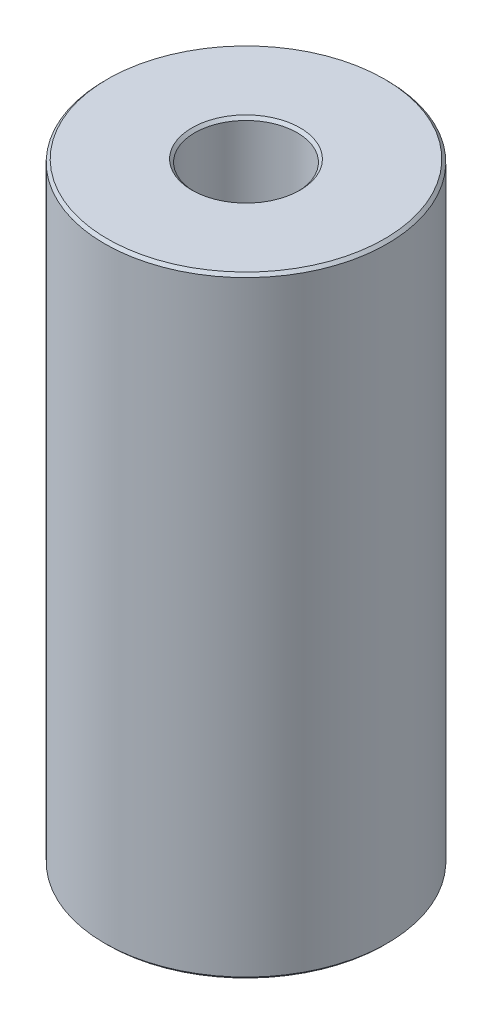
ISO-10303-21;
HEADER;
FILE_DESCRIPTION(('STEP AP214'),'2;1');
FILE_NAME('part.step','',(''),(''),'','','');
FILE_SCHEMA(('AUTOMOTIVE_DESIGN { 1 0 10303 214 1 1 1 1 }'));
ENDSEC;
DATA;
#1=APPLICATION_CONTEXT('core data for automotive mechanical design processes');
#2=APPLICATION_PROTOCOL_DEFINITION('international standard','automotive_design',2000,#1);
#3=PRODUCT_CONTEXT('',#1,'mechanical');
#4=PRODUCT('Part','Part','',(#3));
#5=PRODUCT_RELATED_PRODUCT_CATEGORY('part','',(#4));
#6=PRODUCT_DEFINITION_FORMATION('','',#4);
#7=PRODUCT_DEFINITION_CONTEXT('part definition',#1,'design');
#8=PRODUCT_DEFINITION('design','',#6,#7);
#9=PRODUCT_DEFINITION_SHAPE('','',#8);
#10=(LENGTH_UNIT() NAMED_UNIT(*) SI_UNIT(.MILLI.,.METRE.));
#11=(NAMED_UNIT(*) PLANE_ANGLE_UNIT() SI_UNIT($,.RADIAN.));
#12=(NAMED_UNIT(*) SI_UNIT($,.STERADIAN.) SOLID_ANGLE_UNIT());
#13=UNCERTAINTY_MEASURE_WITH_UNIT(LENGTH_MEASURE(1.E-05),#10,'distance_accuracy_value','');
#14=(GEOMETRIC_REPRESENTATION_CONTEXT(3) GLOBAL_UNCERTAINTY_ASSIGNED_CONTEXT((#13)) GLOBAL_UNIT_ASSIGNED_CONTEXT((#10,
#11,#12)) REPRESENTATION_CONTEXT('',''));
#15=CARTESIAN_POINT('',(0.,0.,0.));
#16=DIRECTION('',(0.,0.,1.));
#17=DIRECTION('',(1.,0.,0.));
#18=AXIS2_PLACEMENT_3D('',#15,#16,#17);
#19=CARTESIAN_POINT('',(0.,75.7217273491963,0.));
#20=DIRECTION('',(0.,-1.,0.));
#21=DIRECTION('',(0.,0.,-1.));
#22=AXIS2_PLACEMENT_3D('',#19,#20,#21);
#23=CYLINDRICAL_SURFACE('',#22,17.5);
#24=CARTESIAN_POINT('',(0.,0.350058036582654,0.));
#25=DIRECTION('',(0.,1.,0.));
#26=DIRECTION('',(0.,0.,1.));
#27=AXIS2_PLACEMENT_3D('',#24,#25,#26);
#28=CIRCLE('',#27,17.5);
#29=CARTESIAN_POINT('',(0.,0.350058036582654,-17.5));
#30=VERTEX_POINT('',#29);
#31=EDGE_CURVE('E10',#30,#30,#28,.T.);
#32=CARTESIAN_POINT('',(0.,75.3716693126136,0.));
#33=DIRECTION('',(0.,1.,0.));
#34=DIRECTION('',(0.,0.,1.));
#35=AXIS2_PLACEMENT_3D('',#32,#33,#34);
#36=CIRCLE('',#35,17.5);
#37=CARTESIAN_POINT('',(0.,75.3716693126136,-17.5));
#38=VERTEX_POINT('',#37);
#39=EDGE_CURVE('E50',#38,#38,#36,.F.);
#40=CARTESIAN_POINT('',(0.,0.350058036582654,-17.5));
#41=CARTESIAN_POINT('',(0.,1.13153315404131,-17.5));
#42=CARTESIAN_POINT('',(0.,1.91300827149997,-17.5));
#43=CARTESIAN_POINT('',(0.,3.47595850641728,-17.5));
#44=CARTESIAN_POINT('',(0.,4.25743362387593,-17.5));
#45=CARTESIAN_POINT('',(0.,5.82038385879324,-17.5));
#46=CARTESIAN_POINT('',(0.,6.6018589762519,-17.5));
#47=CARTESIAN_POINT('',(0.,8.16480921116921,-17.5));
#48=CARTESIAN_POINT('',(0.,8.94628432862786,-17.5));
#49=CARTESIAN_POINT('',(0.,10.5092345635452,-17.5));
#50=CARTESIAN_POINT('',(0.,11.2907096810038,-17.5));
#51=CARTESIAN_POINT('',(0.,12.8536599159211,-17.5));
#52=CARTESIAN_POINT('',(0.,13.6351350333798,-17.5));
#53=CARTESIAN_POINT('',(0.,15.1980852682971,-17.5));
#54=CARTESIAN_POINT('',(0.,15.9795603857558,-17.5));
#55=CARTESIAN_POINT('',(0.,17.5425106206731,-17.5));
#56=CARTESIAN_POINT('',(0.,18.3239857381317,-17.5));
#57=CARTESIAN_POINT('',(0.,19.886935973049,-17.5));
#58=CARTESIAN_POINT('',(0.,20.6684110905077,-17.5));
#59=CARTESIAN_POINT('',(0.,22.231361325425,-17.5));
#60=CARTESIAN_POINT('',(0.,23.0128364428837,-17.5));
#61=CARTESIAN_POINT('',(0.,24.575786677801,-17.5));
#62=CARTESIAN_POINT('',(0.,25.3572617952596,-17.5));
#63=CARTESIAN_POINT('',(0.,26.920212030177,-17.5));
#64=CARTESIAN_POINT('',(0.,27.7016871476356,-17.5));
#65=CARTESIAN_POINT('',(0.,29.2646373825529,-17.5));
#66=CARTESIAN_POINT('',(0.,30.0461125000116,-17.5));
#67=CARTESIAN_POINT('',(0.,31.6090627349289,-17.5));
#68=CARTESIAN_POINT('',(0.,32.3905378523875,-17.5));
#69=CARTESIAN_POINT('',(0.,33.9534880873049,-17.5));
#70=CARTESIAN_POINT('',(0.,34.7349632047635,-17.5));
#71=CARTESIAN_POINT('',(0.,36.2979134396808,-17.5));
#72=CARTESIAN_POINT('',(0.,37.0793885571395,-17.5));
#73=CARTESIAN_POINT('',(0.,38.6423387920568,-17.5));
#74=CARTESIAN_POINT('',(0.,39.4238139095154,-17.5));
#75=CARTESIAN_POINT('',(0.,40.9867641444328,-17.5));
#76=CARTESIAN_POINT('',(0.,41.7682392618914,-17.5));
#77=CARTESIAN_POINT('',(0.,43.3311894968087,-17.5));
#78=CARTESIAN_POINT('',(0.,44.1126646142674,-17.5));
#79=CARTESIAN_POINT('',(0.,45.6756148491847,-17.5));
#80=CARTESIAN_POINT('',(0.,46.4570899666434,-17.5));
#81=CARTESIAN_POINT('',(0.,48.0200402015607,-17.5));
#82=CARTESIAN_POINT('',(0.,48.8015153190193,-17.5));
#83=CARTESIAN_POINT('',(0.,50.3644655539366,-17.5));
#84=CARTESIAN_POINT('',(0.,51.1459406713953,-17.5));
#85=CARTESIAN_POINT('',(0.,52.7088909063126,-17.5));
#86=CARTESIAN_POINT('',(0.,53.4903660237713,-17.5));
#87=CARTESIAN_POINT('',(0.,55.0533162586886,-17.5));
#88=CARTESIAN_POINT('',(0.,55.8347913761472,-17.5));
#89=CARTESIAN_POINT('',(0.,57.3977416110645,-17.5));
#90=CARTESIAN_POINT('',(0.,58.1792167285232,-17.5));
#91=CARTESIAN_POINT('',(0.,59.7421669634405,-17.5));
#92=CARTESIAN_POINT('',(0.,60.5236420808992,-17.5));
#93=CARTESIAN_POINT('',(0.,62.0865923158165,-17.5));
#94=CARTESIAN_POINT('',(0.,62.8680674332751,-17.5));
#95=CARTESIAN_POINT('',(0.,64.4310176681924,-17.5));
#96=CARTESIAN_POINT('',(0.,65.2124927856511,-17.5));
#97=CARTESIAN_POINT('',(0.,66.7754430205684,-17.5));
#98=CARTESIAN_POINT('',(0.,67.5569181380271,-17.5));
#99=CARTESIAN_POINT('',(0.,69.1198683729444,-17.5));
#100=CARTESIAN_POINT('',(0.,69.901343490403,-17.5));
#101=CARTESIAN_POINT('',(0.,71.4642937253203,-17.5));
#102=CARTESIAN_POINT('',(0.,72.245768842779,-17.5));
#103=CARTESIAN_POINT('',(0.,73.8087190776963,-17.5));
#104=CARTESIAN_POINT('',(0.,74.590194195155,-17.5));
#105=CARTESIAN_POINT('',(0.,75.3716693126136,-17.5));
#106=B_SPLINE_CURVE_WITH_KNOTS('',3,(#40,#41,#42,#43,#44,#45,#46,#47,#48,#49,#50,#51,#52,#53,
#54,#55,#56,#57,#58,#59,#60,#61,#62,#63,#64,#65,#66,#67,#68,#69,#70,#71,#72,#73,#74,#75,#76,#77,
#78,#79,#80,#81,#82,#83,#84,#85,#86,#87,#88,#89,#90,#91,#92,#93,#94,#95,#96,#97,#98,#99,#100,
#101,#102,#103,#104,#105),.UNSPECIFIED.,.F.,.F.,(4,2,2,2,2,2,2,2,2,2,2,2,2,2,2,2,2,2,2,2,2,2,2,
2,2,2,2,2,2,2,2,2,4),(0.,2.34442535237597,4.68885070475193,7.0332760571279,9.37770140950386,
11.7221267618798,14.0665521142558,16.4109774666318,18.7554028190077,21.0998281713837,
23.4442535237597,25.7886788761356,28.1331042285116,30.4775295808876,32.8219549332635,
35.1663802856395,37.5108056380155,39.8552309903914,42.1996563427674,44.5440816951434,
46.8885070475194,49.2329323998953,51.5773577522713,53.9217831046473,56.2662084570232,
58.6106338093992,60.9550591617752,63.2994845141511,65.6439098665271,67.9883352189031,
70.332760571279,72.677185923655,75.021611276031),.UNSPECIFIED.);
#107=EDGE_CURVE('BSEAM39',#30,#38,#106,.T.);
#108=ORIENTED_EDGE('',*,*,#31,.T.);
#109=ORIENTED_EDGE('',*,*,#39,.T.);
#110=ORIENTED_EDGE('',*,*,#107,.T.);
#111=ORIENTED_EDGE('',*,*,#107,.F.);
#112=EDGE_LOOP('',(#108,#110,#109,#111));
#113=FACE_BOUND('',#112,.T.);
#114=ADVANCED_FACE('F39',(#113),#23,.T.);
#115=CARTESIAN_POINT('',(0.,75.7217273491963,0.));
#116=DIRECTION('',(0.,1.,0.));
#117=DIRECTION('',(0.,0.,1.));
#118=AXIS2_PLACEMENT_3D('',#115,#116,#117);
#119=PLANE('',#118);
#120=CARTESIAN_POINT('',(0.,75.7217273491963,0.));
#121=DIRECTION('',(0.,1.,0.));
#122=DIRECTION('',(0.,0.,1.));
#123=AXIS2_PLACEMENT_3D('',#120,#121,#122);
#124=CIRCLE('',#123,6.69590160339195);
#125=CARTESIAN_POINT('',(0.,75.7217273491963,6.69590160339195));
#126=VERTEX_POINT('',#125);
#127=EDGE_CURVE('E58',#126,#126,#124,.F.);
#128=ORIENTED_EDGE('',*,*,#127,.T.);
#129=EDGE_LOOP('',(#128));
#130=FACE_BOUND('',#129,.T.);
#131=CARTESIAN_POINT('',(0.,75.7217273491963,0.));
#132=DIRECTION('',(0.,1.,0.));
#133=DIRECTION('',(0.,0.,1.));
#134=AXIS2_PLACEMENT_3D('',#131,#132,#133);
#135=CIRCLE('',#134,17.1499419634174);
#136=CARTESIAN_POINT('',(0.,75.7217273491962,-17.1499419634174));
#137=VERTEX_POINT('',#136);
#138=EDGE_CURVE('E61',#137,#137,#135,.T.);
#139=ORIENTED_EDGE('',*,*,#138,.T.);
#140=EDGE_LOOP('',(#139));
#141=FACE_BOUND('',#140,.T.);
#142=ADVANCED_FACE('F88',(#130,#141),#119,.T.);
#143=CARTESIAN_POINT('',(0.,0.,0.));
#144=DIRECTION('',(0.,1.,0.));
#145=DIRECTION('',(0.,0.,1.));
#146=AXIS2_PLACEMENT_3D('',#143,#144,#145);
#147=PLANE('',#146);
#148=CARTESIAN_POINT('',(0.,0.,0.));
#149=DIRECTION('',(0.,1.,0.));
#150=DIRECTION('',(0.,0.,1.));
#151=AXIS2_PLACEMENT_3D('',#148,#149,#150);
#152=CIRCLE('',#151,6.69590160339199);
#153=CARTESIAN_POINT('',(0.,0.,-6.69590160339199));
#154=VERTEX_POINT('',#153);
#155=EDGE_CURVE('E51',#154,#154,#152,.T.);
#156=ORIENTED_EDGE('',*,*,#155,.T.);
#157=EDGE_LOOP('',(#156));
#158=FACE_BOUND('',#157,.T.);
#159=CARTESIAN_POINT('',(0.,0.,0.));
#160=DIRECTION('',(0.,1.,0.));
#161=DIRECTION('',(0.,0.,1.));
#162=AXIS2_PLACEMENT_3D('',#159,#160,#161);
#163=CIRCLE('',#162,17.1499419634174);
#164=CARTESIAN_POINT('',(0.,0.,17.1499419634174));
#165=VERTEX_POINT('',#164);
#166=EDGE_CURVE('E54',#165,#165,#163,.F.);
#167=ORIENTED_EDGE('',*,*,#166,.T.);
#168=EDGE_LOOP('',(#167));
#169=FACE_BOUND('',#168,.T.);
#170=ADVANCED_FACE('F83',(#158,#169),#147,.F.);
#171=CARTESIAN_POINT('',(0.,75.7217273491963,0.));
#172=DIRECTION('',(0.,-1.,0.));
#173=DIRECTION('',(0.,0.,-1.));
#174=AXIS2_PLACEMENT_3D('',#171,#172,#173);
#175=CYLINDRICAL_SURFACE('',#174,6.34584356680934);
#176=CARTESIAN_POINT('',(0.,75.3716693126136,0.));
#177=DIRECTION('',(0.,1.,0.));
#178=DIRECTION('',(0.,0.,1.));
#179=AXIS2_PLACEMENT_3D('',#176,#177,#178);
#180=CIRCLE('',#179,6.34584356680934);
#181=CARTESIAN_POINT('',(0.,75.3716693126136,-6.34584356680934));
#182=VERTEX_POINT('',#181);
#183=EDGE_CURVE('E67',#182,#182,#180,.T.);
#184=CARTESIAN_POINT('',(0.,0.35005803658264,0.));
#185=DIRECTION('',(0.,1.,0.));
#186=DIRECTION('',(0.,0.,1.));
#187=AXIS2_PLACEMENT_3D('',#184,#185,#186);
#188=CIRCLE('',#187,6.34584356680934);
#189=CARTESIAN_POINT('',(0.,0.350058036582626,-6.34584356680934));
#190=VERTEX_POINT('',#189);
#191=EDGE_CURVE('E69',#190,#190,#188,.F.);
#192=CARTESIAN_POINT('',(0.,75.3716693126136,-6.34584356680934));
#193=CARTESIAN_POINT('',(0.,74.590194195155,-6.34584356680934));
#194=CARTESIAN_POINT('',(0.,73.8087190776963,-6.34584356680934));
#195=CARTESIAN_POINT('',(0.,72.245768842779,-6.34584356680934));
#196=CARTESIAN_POINT('',(0.,71.4642937253204,-6.34584356680934));
#197=CARTESIAN_POINT('',(0.,69.901343490403,-6.34584356680934));
#198=CARTESIAN_POINT('',(0.,69.1198683729444,-6.34584356680934));
#199=CARTESIAN_POINT('',(0.,67.5569181380271,-6.34584356680934));
#200=CARTESIAN_POINT('',(0.,66.7754430205684,-6.34584356680934));
#201=CARTESIAN_POINT('',(0.,65.2124927856511,-6.34584356680934));
#202=CARTESIAN_POINT('',(0.,64.4310176681925,-6.34584356680934));
#203=CARTESIAN_POINT('',(0.,62.8680674332751,-6.34584356680934));
#204=CARTESIAN_POINT('',(0.,62.0865923158165,-6.34584356680934));
#205=CARTESIAN_POINT('',(0.,60.5236420808992,-6.34584356680934));
#206=CARTESIAN_POINT('',(0.,59.7421669634405,-6.34584356680934));
#207=CARTESIAN_POINT('',(0.,58.1792167285232,-6.34584356680934));
#208=CARTESIAN_POINT('',(0.,57.3977416110645,-6.34584356680934));
#209=CARTESIAN_POINT('',(0.,55.8347913761472,-6.34584356680934));
#210=CARTESIAN_POINT('',(0.,55.0533162586886,-6.34584356680934));
#211=CARTESIAN_POINT('',(0.,53.4903660237713,-6.34584356680934));
#212=CARTESIAN_POINT('',(0.,52.7088909063126,-6.34584356680934));
#213=CARTESIAN_POINT('',(0.,51.1459406713953,-6.34584356680934));
#214=CARTESIAN_POINT('',(0.,50.3644655539366,-6.34584356680934));
#215=CARTESIAN_POINT('',(0.,48.8015153190193,-6.34584356680934));
#216=CARTESIAN_POINT('',(0.,48.0200402015607,-6.34584356680934));
#217=CARTESIAN_POINT('',(0.,46.4570899666434,-6.34584356680934));
#218=CARTESIAN_POINT('',(0.,45.6756148491847,-6.34584356680934));
#219=CARTESIAN_POINT('',(0.,44.1126646142674,-6.34584356680934));
#220=CARTESIAN_POINT('',(0.,43.3311894968087,-6.34584356680934));
#221=CARTESIAN_POINT('',(0.,41.7682392618914,-6.34584356680934));
#222=CARTESIAN_POINT('',(0.,40.9867641444328,-6.34584356680934));
#223=CARTESIAN_POINT('',(0.,39.4238139095154,-6.34584356680934));
#224=CARTESIAN_POINT('',(0.,38.6423387920568,-6.34584356680934));
#225=CARTESIAN_POINT('',(0.,37.0793885571395,-6.34584356680934));
#226=CARTESIAN_POINT('',(0.,36.2979134396808,-6.34584356680934));
#227=CARTESIAN_POINT('',(0.,34.7349632047635,-6.34584356680934));
#228=CARTESIAN_POINT('',(0.,33.9534880873048,-6.34584356680934));
#229=CARTESIAN_POINT('',(0.,32.3905378523875,-6.34584356680934));
#230=CARTESIAN_POINT('',(0.,31.6090627349289,-6.34584356680934));
#231=CARTESIAN_POINT('',(0.,30.0461125000116,-6.34584356680934));
#232=CARTESIAN_POINT('',(0.,29.2646373825529,-6.34584356680934));
#233=CARTESIAN_POINT('',(0.,27.7016871476356,-6.34584356680934));
#234=CARTESIAN_POINT('',(0.,26.9202120301769,-6.34584356680934));
#235=CARTESIAN_POINT('',(0.,25.3572617952596,-6.34584356680934));
#236=CARTESIAN_POINT('',(0.,24.575786677801,-6.34584356680934));
#237=CARTESIAN_POINT('',(0.,23.0128364428837,-6.34584356680934));
#238=CARTESIAN_POINT('',(0.,22.231361325425,-6.34584356680934));
#239=CARTESIAN_POINT('',(0.,20.6684110905077,-6.34584356680934));
#240=CARTESIAN_POINT('',(0.,19.886935973049,-6.34584356680934));
#241=CARTESIAN_POINT('',(0.,18.3239857381317,-6.34584356680934));
#242=CARTESIAN_POINT('',(0.,17.5425106206731,-6.34584356680934));
#243=CARTESIAN_POINT('',(0.,15.9795603857557,-6.34584356680934));
#244=CARTESIAN_POINT('',(0.,15.1980852682971,-6.34584356680934));
#245=CARTESIAN_POINT('',(0.,13.6351350333798,-6.34584356680934));
#246=CARTESIAN_POINT('',(0.,12.8536599159211,-6.34584356680934));
#247=CARTESIAN_POINT('',(0.,11.2907096810038,-6.34584356680934));
#248=CARTESIAN_POINT('',(0.,10.5092345635451,-6.34584356680934));
#249=CARTESIAN_POINT('',(0.,8.94628432862783,-6.34584356680934));
#250=CARTESIAN_POINT('',(0.,8.16480921116917,-6.34584356680934));
#251=CARTESIAN_POINT('',(0.,6.60185897625187,-6.34584356680934));
#252=CARTESIAN_POINT('',(0.,5.82038385879322,-6.34584356680934));
#253=CARTESIAN_POINT('',(0.,4.25743362387591,-6.34584356680934));
#254=CARTESIAN_POINT('',(0.,3.47595850641726,-6.34584356680934));
#255=CARTESIAN_POINT('',(0.,1.91300827149994,-6.34584356680934));
#256=CARTESIAN_POINT('',(0.,1.13153315404128,-6.34584356680934));
#257=CARTESIAN_POINT('',(0.,0.350058036582626,-6.34584356680934));
#258=B_SPLINE_CURVE_WITH_KNOTS('',3,(#192,#193,#194,#195,#196,#197,#198,#199,#200,#201,#202,
#203,#204,#205,#206,#207,#208,#209,#210,#211,#212,#213,#214,#215,#216,#217,#218,#219,#220,#221,
#222,#223,#224,#225,#226,#227,#228,#229,#230,#231,#232,#233,#234,#235,#236,#237,#238,#239,#240,
#241,#242,#243,#244,#245,#246,#247,#248,#249,#250,#251,#252,#253,#254,#255,#256,#257),
.UNSPECIFIED.,.F.,.F.,(4,2,2,2,2,2,2,2,2,2,2,2,2,2,2,2,2,2,2,2,2,2,2,2,2,2,2,2,2,2,2,2,4),(0.,
2.34442535237596,4.68885070475193,7.0332760571279,9.37770140950386,11.7221267618798,
14.0665521142558,16.4109774666318,18.7554028190077,21.0998281713837,23.4442535237597,
25.7886788761357,28.1331042285116,30.4775295808876,32.8219549332636,35.1663802856395,
37.5108056380155,39.8552309903915,42.1996563427674,44.5440816951434,46.8885070475194,
49.2329323998954,51.5773577522713,53.9217831046473,56.2662084570233,58.6106338093992,
60.9550591617752,63.2994845141512,65.6439098665271,67.9883352189031,70.3327605712791,
72.677185923655,75.021611276031),.UNSPECIFIED.);
#259=EDGE_CURVE('BSEAM71',#182,#190,#258,.T.);
#260=ORIENTED_EDGE('',*,*,#183,.T.);
#261=ORIENTED_EDGE('',*,*,#191,.T.);
#262=ORIENTED_EDGE('',*,*,#259,.T.);
#263=ORIENTED_EDGE('',*,*,#259,.F.);
#264=EDGE_LOOP('',(#260,#262,#261,#263));
#265=FACE_BOUND('',#264,.T.);
#266=ADVANCED_FACE('F71',(#265),#175,.F.);
#267=CARTESIAN_POINT('',(0.,75.3716693126136,0.));
#268=DIRECTION('',(0.,1.,0.));
#269=DIRECTION('',(0.,0.,1.));
#270=AXIS2_PLACEMENT_3D('',#267,#268,#269);
#271=CONICAL_SURFACE('',#270,6.34584356680934,0.785398163397445);
#272=ORIENTED_EDGE('',*,*,#127,.F.);
#273=EDGE_LOOP('',(#272));
#274=FACE_BOUND('',#273,.T.);
#275=ORIENTED_EDGE('',*,*,#183,.F.);
#276=EDGE_LOOP('',(#275));
#277=FACE_BOUND('',#276,.T.);
#278=ADVANCED_FACE('F77',(#274,#277),#271,.F.);
#279=CARTESIAN_POINT('',(0.,0.,0.));
#280=DIRECTION('',(0.,-1.,0.));
#281=DIRECTION('',(0.,0.,-1.));
#282=AXIS2_PLACEMENT_3D('',#279,#280,#281);
#283=CONICAL_SURFACE('',#282,6.69590160339199,0.785398163397454);
#284=CARTESIAN_POINT('',(0.,0.35005803658264,-6.34584356680934));
#285=CARTESIAN_POINT('',(0.,0.346411598701571,-6.34949000469041));
#286=CARTESIAN_POINT('',(0.,0.342765160820502,-6.35313644257148));
#287=CARTESIAN_POINT('',(0.,0.335472285058363,-6.36042931833362));
#288=CARTESIAN_POINT('',(0.,0.331825847177294,-6.36407575621469));
#289=CARTESIAN_POINT('',(0.,0.324532971415156,-6.37136863197683));
#290=CARTESIAN_POINT('',(0.,0.320886533534087,-6.3750150698579));
#291=CARTESIAN_POINT('',(0.,0.313593657771948,-6.38230794562003));
#292=CARTESIAN_POINT('',(0.,0.309947219890879,-6.3859543835011));
#293=CARTESIAN_POINT('',(0.,0.302654344128741,-6.39324725926324));
#294=CARTESIAN_POINT('',(0.,0.299007906247672,-6.39689369714431));
#295=CARTESIAN_POINT('',(0.,0.291715030485533,-6.40418657290645));
#296=CARTESIAN_POINT('',(0.,0.288068592604464,-6.40783301078752));
#297=CARTESIAN_POINT('',(0.,0.280775716842326,-6.41512588654966));
#298=CARTESIAN_POINT('',(0.,0.277129278961257,-6.41877232443073));
#299=CARTESIAN_POINT('',(0.,0.269836403199118,-6.42606520019287));
#300=CARTESIAN_POINT('',(0.,0.266189965318049,-6.42971163807393));
#301=CARTESIAN_POINT('',(0.,0.258897089555911,-6.43700451383607));
#302=CARTESIAN_POINT('',(0.,0.255250651674842,-6.44065095171714));
#303=CARTESIAN_POINT('',(0.,0.247957775912703,-6.44794382747928));
#304=CARTESIAN_POINT('',(0.,0.244311338031634,-6.45159026536035));
#305=CARTESIAN_POINT('',(0.,0.237018462269496,-6.45888314112249));
#306=CARTESIAN_POINT('',(0.,0.233372024388427,-6.46252957900356));
#307=CARTESIAN_POINT('',(0.,0.226079148626288,-6.4698224547657));
#308=CARTESIAN_POINT('',(0.,0.222432710745219,-6.47346889264676));
#309=CARTESIAN_POINT('',(0.,0.215139834983081,-6.4807617684089));
#310=CARTESIAN_POINT('',(0.,0.211493397102012,-6.48440820628997));
#311=CARTESIAN_POINT('',(0.,0.204200521339873,-6.49170108205211));
#312=CARTESIAN_POINT('',(0.,0.200554083458804,-6.49534751993318));
#313=CARTESIAN_POINT('',(0.,0.193261207696666,-6.50264039569532));
#314=CARTESIAN_POINT('',(0.,0.189614769815597,-6.50628683357639));
#315=CARTESIAN_POINT('',(0.,0.182321894053458,-6.51357970933853));
#316=CARTESIAN_POINT('',(0.,0.178675456172389,-6.51722614721959));
#317=CARTESIAN_POINT('',(0.,0.171382580410251,-6.52451902298173));
#318=CARTESIAN_POINT('',(0.,0.167736142529182,-6.5281654608628));
#319=CARTESIAN_POINT('',(0.,0.160443266767043,-6.53545833662494));
#320=CARTESIAN_POINT('',(0.,0.156796828885974,-6.53910477450601));
#321=CARTESIAN_POINT('',(0.,0.149503953123836,-6.54639765026815));
#322=CARTESIAN_POINT('',(0.,0.145857515242767,-6.55004408814922));
#323=CARTESIAN_POINT('',(0.,0.138564639480628,-6.55733696391136));
#324=CARTESIAN_POINT('',(0.,0.134918201599559,-6.56098340179243));
#325=CARTESIAN_POINT('',(0.,0.127625325837421,-6.56827627755457));
#326=CARTESIAN_POINT('',(0.,0.123978887956352,-6.57192271543563));
#327=CARTESIAN_POINT('',(0.,0.116686012194213,-6.57921559119777));
#328=CARTESIAN_POINT('',(0.,0.113039574313144,-6.58286202907884));
#329=CARTESIAN_POINT('',(0.,0.105746698551006,-6.59015490484098));
#330=CARTESIAN_POINT('',(0.,0.102100260669937,-6.59380134272205));
#331=CARTESIAN_POINT('',(0.,0.0948073849077984,-6.60109421848419));
#332=CARTESIAN_POINT('',(0.,0.0911609470267292,-6.60474065636526));
#333=CARTESIAN_POINT('',(0.,0.0838680712645908,-6.6120335321274));
#334=CARTESIAN_POINT('',(0.,0.0802216333835216,-6.61567997000846));
#335=CARTESIAN_POINT('',(0.,0.0729287576213833,-6.6229728457706));
#336=CARTESIAN_POINT('',(0.,0.0692823197403142,-6.62661928365167));
#337=CARTESIAN_POINT('',(0.,0.0619894439781758,-6.63391215941381));
#338=CARTESIAN_POINT('',(0.,0.0583430060971067,-6.63755859729488));
#339=CARTESIAN_POINT('',(0.,0.0510501303349683,-6.64485147305702));
#340=CARTESIAN_POINT('',(0.,0.0474036924538991,-6.64849791093809));
#341=CARTESIAN_POINT('',(0.,0.0401108166917608,-6.65579078670023));
#342=CARTESIAN_POINT('',(0.,0.0364643788106917,-6.6594372245813));
#343=CARTESIAN_POINT('',(0.,0.0291715030485534,-6.66673010034343));
#344=CARTESIAN_POINT('',(0.,0.0255250651674842,-6.6703765382245));
#345=CARTESIAN_POINT('',(0.,0.0182321894053458,-6.67766941398664));
#346=CARTESIAN_POINT('',(0.,0.0145857515242767,-6.68131585186771));
#347=CARTESIAN_POINT('',(0.,0.00729287576213834,-6.68860872762985));
#348=CARTESIAN_POINT('',(0.,0.00364643788106919,-6.69225516551092));
#349=CARTESIAN_POINT('',(0.,0.,-6.69590160339199));
#350=B_SPLINE_CURVE_WITH_KNOTS('',3,(#284,#285,#286,#287,#288,#289,#290,#291,#292,#293,#294,
#295,#296,#297,#298,#299,#300,#301,#302,#303,#304,#305,#306,#307,#308,#309,#310,#311,#312,#313,
#314,#315,#316,#317,#318,#319,#320,#321,#322,#323,#324,#325,#326,#327,#328,#329,#330,#331,#332,
#333,#334,#335,#336,#337,#338,#339,#340,#341,#342,#343,#344,#345,#346,#347,#348,#349),
.UNSPECIFIED.,.F.,.F.,(4,2,2,2,2,2,2,2,2,2,2,2,2,2,2,2,2,2,2,2,2,2,2,2,2,2,2,2,2,2,2,2,4),(0.,
0.0154705257172771,0.0309410514345542,0.0464115771518312,0.0618821028691089,0.077352628586386,
0.0928231543036631,0.10829368002094,0.123764205738217,0.139234731455494,0.154705257172772,
0.170175782890049,0.185646308607326,0.201116834324603,0.21658736004188,0.232057885759157,
0.247528411476434,0.262998937193712,0.278469462910989,0.293939988628266,0.309410514345543,
0.32488104006282,0.340351565780098,0.355822091497375,0.371292617214652,0.386763142931929,
0.402233668649206,0.417704194366483,0.433174720083761,0.448645245801038,0.464115771518315,
0.479586297235592,0.49505682295287),.UNSPECIFIED.);
#351=EDGE_CURVE('BSEAM73',#190,#154,#350,.T.);
#352=ORIENTED_EDGE('',*,*,#191,.F.);
#353=ORIENTED_EDGE('',*,*,#155,.F.);
#354=ORIENTED_EDGE('',*,*,#351,.T.);
#355=ORIENTED_EDGE('',*,*,#351,.F.);
#356=EDGE_LOOP('',(#352,#354,#353,#355));
#357=FACE_BOUND('',#356,.T.);
#358=ADVANCED_FACE('F73',(#357),#283,.F.);
#359=CARTESIAN_POINT('',(0.,0.350058036582654,0.));
#360=DIRECTION('',(0.,1.,0.));
#361=DIRECTION('',(0.,0.,1.));
#362=AXIS2_PLACEMENT_3D('',#359,#360,#361);
#363=CONICAL_SURFACE('',#362,17.5,0.785398163397443);
#364=ORIENTED_EDGE('',*,*,#166,.F.);
#365=EDGE_LOOP('',(#364));
#366=FACE_BOUND('',#365,.T.);
#367=ORIENTED_EDGE('',*,*,#31,.F.);
#368=EDGE_LOOP('',(#367));
#369=FACE_BOUND('',#368,.T.);
#370=ADVANCED_FACE('F76',(#366,#369),#363,.T.);
#371=CARTESIAN_POINT('',(0.,75.7217273491963,0.));
#372=DIRECTION('',(0.,-1.,0.));
#373=DIRECTION('',(0.,0.,-1.));
#374=AXIS2_PLACEMENT_3D('',#371,#372,#373);
#375=CONICAL_SURFACE('',#374,17.1499419634174,0.785398163397453);
#376=CARTESIAN_POINT('',(0.,75.3716693126136,-17.5));
#377=CARTESIAN_POINT('',(0.,75.3753157504947,-17.4963535621189));
#378=CARTESIAN_POINT('',(0.,75.3789621883758,-17.4927071242379));
#379=CARTESIAN_POINT('',(0.,75.3862550641379,-17.4854142484757));
#380=CARTESIAN_POINT('',(0.,75.3899015020189,-17.4817678105947));
#381=CARTESIAN_POINT('',(0.,75.3971943777811,-17.4744749348325));
#382=CARTESIAN_POINT('',(0.,75.4008408156622,-17.4708284969515));
#383=CARTESIAN_POINT('',(0.,75.4081336914243,-17.4635356211893));
#384=CARTESIAN_POINT('',(0.,75.4117801293054,-17.4598891833082));
#385=CARTESIAN_POINT('',(0.,75.4190730050675,-17.4525963075461));
#386=CARTESIAN_POINT('',(0.,75.4227194429486,-17.448949869665));
#387=CARTESIAN_POINT('',(0.,75.4300123187107,-17.4416569939029));
#388=CARTESIAN_POINT('',(0.,75.4336587565918,-17.4380105560218));
#389=CARTESIAN_POINT('',(0.,75.4409516323539,-17.4307176802597));
#390=CARTESIAN_POINT('',(0.,75.444598070235,-17.4270712423786));
#391=CARTESIAN_POINT('',(0.,75.4518909459971,-17.4197783666165));
#392=CARTESIAN_POINT('',(0.,75.4555373838782,-17.4161319287354));
#393=CARTESIAN_POINT('',(0.,75.4628302596403,-17.4088390529733));
#394=CARTESIAN_POINT('',(0.,75.4664766975214,-17.4051926150922));
#395=CARTESIAN_POINT('',(0.,75.4737695732836,-17.3978997393301));
#396=CARTESIAN_POINT('',(0.,75.4774160111646,-17.394253301449));
#397=CARTESIAN_POINT('',(0.,75.4847088869268,-17.3869604256869));
#398=CARTESIAN_POINT('',(0.,75.4883553248078,-17.3833139878058));
#399=CARTESIAN_POINT('',(0.,75.49564820057,-17.3760211120437));
#400=CARTESIAN_POINT('',(0.,75.499294638451,-17.3723746741626));
#401=CARTESIAN_POINT('',(0.,75.5065875142132,-17.3650817984005));
#402=CARTESIAN_POINT('',(0.,75.5102339520942,-17.3614353605194));
#403=CARTESIAN_POINT('',(0.,75.5175268278564,-17.3541424847572));
#404=CARTESIAN_POINT('',(0.,75.5211732657374,-17.3504960468762));
#405=CARTESIAN_POINT('',(0.,75.5284661414996,-17.343203171114));
#406=CARTESIAN_POINT('',(0.,75.5321125793807,-17.339556733233));
#407=CARTESIAN_POINT('',(0.,75.5394054551428,-17.3322638574708));
#408=CARTESIAN_POINT('',(0.,75.5430518930239,-17.3286174195898));
#409=CARTESIAN_POINT('',(0.,75.550344768786,-17.3213245438276));
#410=CARTESIAN_POINT('',(0.,75.5539912066671,-17.3176781059465));
#411=CARTESIAN_POINT('',(0.,75.5612840824292,-17.3103852301844));
#412=CARTESIAN_POINT('',(0.,75.5649305203103,-17.3067387923033));
#413=CARTESIAN_POINT('',(0.,75.5722233960724,-17.2994459165412));
#414=CARTESIAN_POINT('',(0.,75.5758698339535,-17.2957994786601));
#415=CARTESIAN_POINT('',(0.,75.5831627097156,-17.288506602898));
#416=CARTESIAN_POINT('',(0.,75.5868091475967,-17.2848601650169));
#417=CARTESIAN_POINT('',(0.,75.5941020233588,-17.2775672892548));
#418=CARTESIAN_POINT('',(0.,75.5977484612399,-17.2739208513737));
#419=CARTESIAN_POINT('',(0.,75.605041337002,-17.2666279756116));
#420=CARTESIAN_POINT('',(0.,75.6086877748831,-17.2629815377305));
#421=CARTESIAN_POINT('',(0.,75.6159806506452,-17.2556886619684));
#422=CARTESIAN_POINT('',(0.,75.6196270885263,-17.2520422240873));
#423=CARTESIAN_POINT('',(0.,75.6269199642885,-17.2447493483252));
#424=CARTESIAN_POINT('',(0.,75.6305664021695,-17.2411029104441));
#425=CARTESIAN_POINT('',(0.,75.6378592779317,-17.233810034682));
#426=CARTESIAN_POINT('',(0.,75.6415057158127,-17.2301635968009));
#427=CARTESIAN_POINT('',(0.,75.6487985915749,-17.2228707210388));
#428=CARTESIAN_POINT('',(0.,75.6524450294559,-17.2192242831577));
#429=CARTESIAN_POINT('',(0.,75.6597379052181,-17.2119314073955));
#430=CARTESIAN_POINT('',(0.,75.6633843430992,-17.2082849695145));
#431=CARTESIAN_POINT('',(0.,75.6706772188613,-17.2009920937523));
#432=CARTESIAN_POINT('',(0.,75.6743236567423,-17.1973456558713));
#433=CARTESIAN_POINT('',(0.,75.6816165325045,-17.1900527801091));
#434=CARTESIAN_POINT('',(0.,75.6852629703856,-17.1864063422281));
#435=CARTESIAN_POINT('',(0.,75.6925558461477,-17.1791134664659));
#436=CARTESIAN_POINT('',(0.,75.6962022840288,-17.1754670285849));
#437=CARTESIAN_POINT('',(0.,75.7034951597909,-17.1681741528227));
#438=CARTESIAN_POINT('',(0.,75.707141597672,-17.1645277149416));
#439=CARTESIAN_POINT('',(0.,75.7144344734341,-17.1572348391795));
#440=CARTESIAN_POINT('',(0.,75.7180809113152,-17.1535884012984));
#441=CARTESIAN_POINT('',(0.,75.7217273491963,-17.1499419634174));
#442=B_SPLINE_CURVE_WITH_KNOTS('',3,(#376,#377,#378,#379,#380,#381,#382,#383,#384,#385,#386,
#387,#388,#389,#390,#391,#392,#393,#394,#395,#396,#397,#398,#399,#400,#401,#402,#403,#404,#405,
#406,#407,#408,#409,#410,#411,#412,#413,#414,#415,#416,#417,#418,#419,#420,#421,#422,#423,#424,
#425,#426,#427,#428,#429,#430,#431,#432,#433,#434,#435,#436,#437,#438,#439,#440,#441),
.UNSPECIFIED.,.F.,.F.,(4,2,2,2,2,2,2,2,2,2,2,2,2,2,2,2,2,2,2,2,2,2,2,2,2,2,2,2,2,2,2,2,4),(0.,
0.0154705257172685,0.0309410514345493,0.0464115771518276,0.0618821028691059,0.0773526285863842,
0.0928231543036551,0.108293680020933,0.123764205738212,0.139234731455492,0.154705257172771,
0.170175782890039,0.185646308607318,0.201116834324598,0.216587360041877,0.232057885759155,
0.247528411476433,0.262998937193704,0.278469462910983,0.293939988628261,0.309410514345542,
0.32488104006282,0.340351565780089,0.355822091497367,0.371292617214648,0.386763142931926,
0.402233668649204,0.417704194366475,0.433174720083753,0.448645245801032,0.46411577151831,
0.479586297235591,0.495056822952869),.UNSPECIFIED.);
#443=EDGE_CURVE('BSEAM45',#38,#137,#442,.T.);
#444=ORIENTED_EDGE('',*,*,#39,.F.);
#445=ORIENTED_EDGE('',*,*,#138,.F.);
#446=ORIENTED_EDGE('',*,*,#443,.T.);
#447=ORIENTED_EDGE('',*,*,#443,.F.);
#448=EDGE_LOOP('',(#444,#446,#445,#447));
#449=FACE_BOUND('',#448,.T.);
#450=ADVANCED_FACE('F45',(#449),#375,.T.);
#451=CLOSED_SHELL('',(#114,#142,#170,#266,#278,#358,#370,#450));
#452=MANIFOLD_SOLID_BREP('B2',#451);
#453=ADVANCED_BREP_SHAPE_REPRESENTATION('',(#18,#452),#14);
#454=SHAPE_DEFINITION_REPRESENTATION(#9,#453);
ENDSEC;
END-ISO-10303-21;
